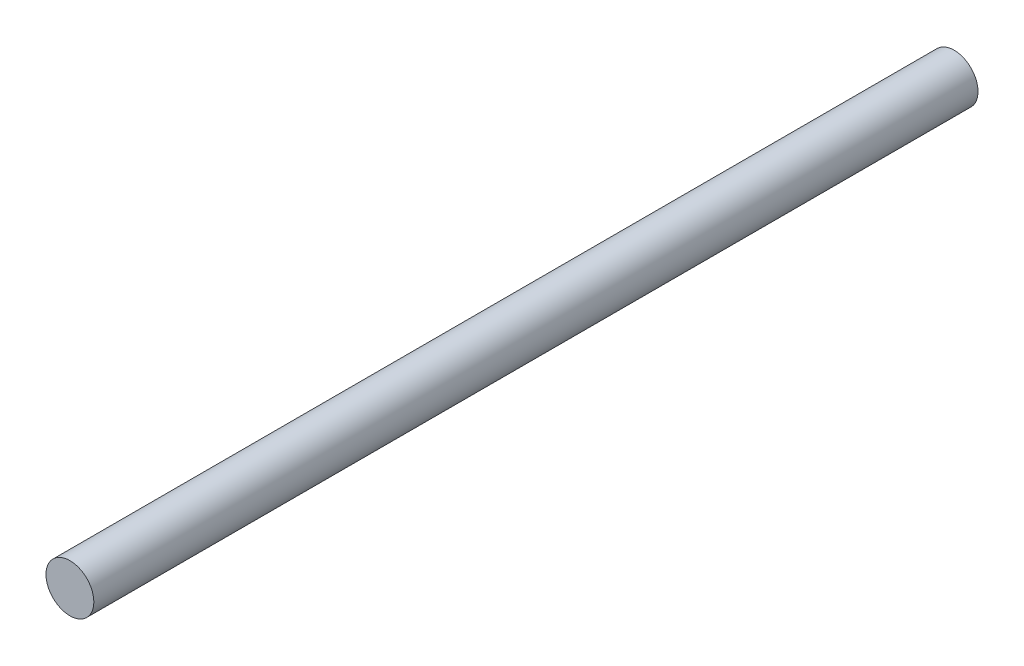
ISO-10303-21;
HEADER;
FILE_DESCRIPTION(('STEP AP214'),'2;1');
FILE_NAME('part.step','',(''),(''),'','','');
FILE_SCHEMA(('AUTOMOTIVE_DESIGN { 1 0 10303 214 1 1 1 1 }'));
ENDSEC;
DATA;
#1=APPLICATION_CONTEXT('core data for automotive mechanical design processes');
#2=APPLICATION_PROTOCOL_DEFINITION('international standard','automotive_design',2000,#1);
#3=PRODUCT_CONTEXT('',#1,'mechanical');
#4=PRODUCT('Part','Part','',(#3));
#5=PRODUCT_RELATED_PRODUCT_CATEGORY('part','',(#4));
#6=PRODUCT_DEFINITION_FORMATION('','',#4);
#7=PRODUCT_DEFINITION_CONTEXT('part definition',#1,'design');
#8=PRODUCT_DEFINITION('design','',#6,#7);
#9=PRODUCT_DEFINITION_SHAPE('','',#8);
#10=(LENGTH_UNIT() NAMED_UNIT(*) SI_UNIT(.MILLI.,.METRE.));
#11=(NAMED_UNIT(*) PLANE_ANGLE_UNIT() SI_UNIT($,.RADIAN.));
#12=(NAMED_UNIT(*) SI_UNIT($,.STERADIAN.) SOLID_ANGLE_UNIT());
#13=UNCERTAINTY_MEASURE_WITH_UNIT(LENGTH_MEASURE(1.E-05),#10,'distance_accuracy_value','');
#14=(GEOMETRIC_REPRESENTATION_CONTEXT(3) GLOBAL_UNCERTAINTY_ASSIGNED_CONTEXT((#13)) GLOBAL_UNIT_ASSIGNED_CONTEXT((#10,
#11,#12)) REPRESENTATION_CONTEXT('',''));
#15=CARTESIAN_POINT('',(0.,0.,0.));
#16=DIRECTION('',(0.,0.,1.));
#17=DIRECTION('',(1.,0.,0.));
#18=AXIS2_PLACEMENT_3D('',#15,#16,#17);
#19=CARTESIAN_POINT('',(-5.49337694596193E-13,-1.8146784623423E-13,211.884260000277));
#20=DIRECTION('',(0.,0.,-1.));
#21=DIRECTION('',(-1.,0.,0.));
#22=AXIS2_PLACEMENT_3D('',#19,#20,#21);
#23=PLANE('',#22);
#24=CARTESIAN_POINT('',(-5.49337694596193E-13,-1.8146784623423E-13,211.884260000277));
#25=DIRECTION('',(0.,0.,-1.));
#26=DIRECTION('',(-1.,0.,0.));
#27=AXIS2_PLACEMENT_3D('',#24,#25,#26);
#28=CIRCLE('',#27,6.34999999999918);
#29=CARTESIAN_POINT('',(-6.34999999999973,-1.8146784623423E-13,211.884260000277));
#30=VERTEX_POINT('',#29);
#31=EDGE_CURVE('E49',#30,#30,#28,.T.);
#32=ORIENTED_EDGE('',*,*,#31,.F.);
#33=EDGE_LOOP('',(#32));
#34=FACE_BOUND('',#33,.T.);
#35=ADVANCED_FACE('F42',(#34),#23,.F.);
#36=CARTESIAN_POINT('',(-5.49337694596193E-13,-1.8146784623423E-13,-40.820512242136));
#37=DIRECTION('',(0.,0.,1.));
#38=DIRECTION('',(1.,0.,0.));
#39=AXIS2_PLACEMENT_3D('',#36,#37,#38);
#40=CYLINDRICAL_SURFACE('',#39,6.34999999999918);
#41=CARTESIAN_POINT('',(-5.49337694596193E-13,-1.8146784623423E-13,-22.86));
#42=DIRECTION('',(0.,0.,1.));
#43=DIRECTION('',(1.,0.,0.));
#44=AXIS2_PLACEMENT_3D('',#41,#42,#43);
#45=CIRCLE('',#44,6.34999999999918);
#46=CARTESIAN_POINT('',(6.34999999999863,-1.8146784623423E-13,-22.86));
#47=VERTEX_POINT('',#46);
#48=EDGE_CURVE('E11',#47,#47,#45,.T.);
#49=ORIENTED_EDGE('',*,*,#48,.T.);
#50=EDGE_LOOP('',(#49));
#51=FACE_BOUND('',#50,.T.);
#52=ORIENTED_EDGE('',*,*,#31,.T.);
#53=EDGE_LOOP('',(#52));
#54=FACE_BOUND('',#53,.T.);
#55=ADVANCED_FACE('F44',(#51,#54),#40,.T.);
#56=CARTESIAN_POINT('',(0.,0.,-22.86));
#57=DIRECTION('',(0.,0.,1.));
#58=DIRECTION('',(1.,0.,0.));
#59=AXIS2_PLACEMENT_3D('',#56,#57,#58);
#60=PLANE('',#59);
#61=ORIENTED_EDGE('',*,*,#48,.F.);
#62=EDGE_LOOP('',(#61));
#63=FACE_BOUND('',#62,.T.);
#64=ADVANCED_FACE('F60',(#63),#60,.F.);
#65=CLOSED_SHELL('',(#35,#55,#64));
#66=MANIFOLD_SOLID_BREP('B2',#65);
#67=ADVANCED_BREP_SHAPE_REPRESENTATION('',(#18,#66),#14);
#68=SHAPE_DEFINITION_REPRESENTATION(#9,#67);
ENDSEC;
END-ISO-10303-21;
